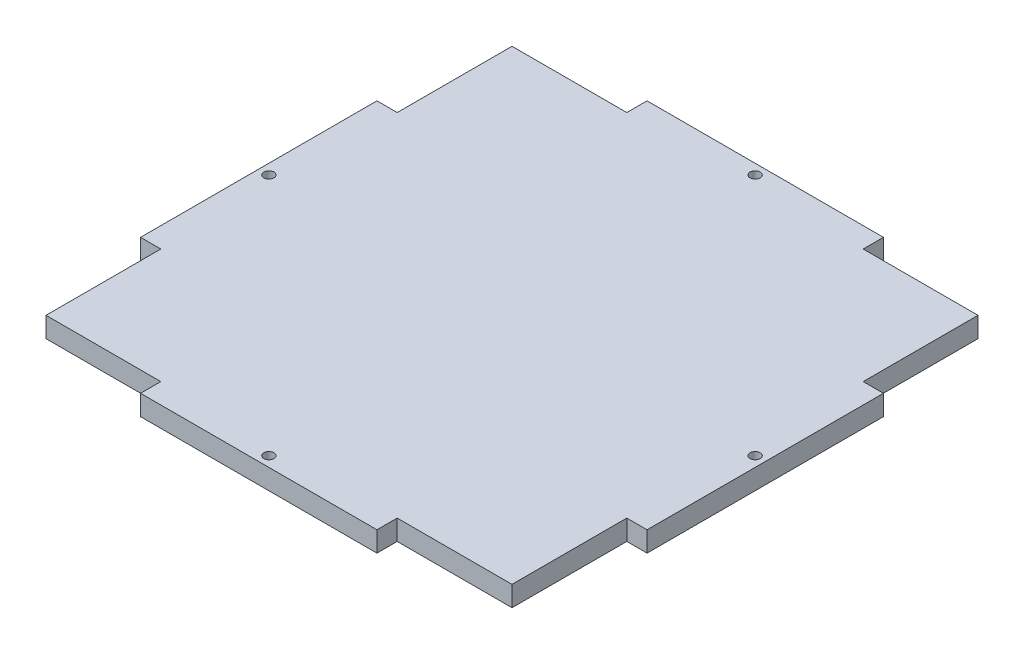
ISO-10303-21;
HEADER;
FILE_DESCRIPTION(('STEP AP214'),'2;1');
FILE_NAME('part.step','',(''),(''),'','','');
FILE_SCHEMA(('AUTOMOTIVE_DESIGN { 1 0 10303 214 1 1 1 1 }'));
ENDSEC;
DATA;
#1=APPLICATION_CONTEXT('core data for automotive mechanical design processes');
#2=APPLICATION_PROTOCOL_DEFINITION('international standard','automotive_design',2000,#1);
#3=PRODUCT_CONTEXT('',#1,'mechanical');
#4=PRODUCT('Part','Part','',(#3));
#5=PRODUCT_RELATED_PRODUCT_CATEGORY('part','',(#4));
#6=PRODUCT_DEFINITION_FORMATION('','',#4);
#7=PRODUCT_DEFINITION_CONTEXT('part definition',#1,'design');
#8=PRODUCT_DEFINITION('design','',#6,#7);
#9=PRODUCT_DEFINITION_SHAPE('','',#8);
#10=(LENGTH_UNIT() NAMED_UNIT(*) SI_UNIT(.MILLI.,.METRE.));
#11=(NAMED_UNIT(*) PLANE_ANGLE_UNIT() SI_UNIT($,.RADIAN.));
#12=(NAMED_UNIT(*) SI_UNIT($,.STERADIAN.) SOLID_ANGLE_UNIT());
#13=UNCERTAINTY_MEASURE_WITH_UNIT(LENGTH_MEASURE(1.E-05),#10,'distance_accuracy_value','');
#14=(GEOMETRIC_REPRESENTATION_CONTEXT(3) GLOBAL_UNCERTAINTY_ASSIGNED_CONTEXT((#13)) GLOBAL_UNIT_ASSIGNED_CONTEXT((#10,
#11,#12)) REPRESENTATION_CONTEXT('',''));
#15=CARTESIAN_POINT('',(0.,0.,0.));
#16=DIRECTION('',(0.,0.,1.));
#17=DIRECTION('',(1.,0.,0.));
#18=AXIS2_PLACEMENT_3D('',#15,#16,#17);
#19=CARTESIAN_POINT('',(-69.,6.,0.));
#20=DIRECTION('',(1.,0.,0.));
#21=DIRECTION('',(0.,0.,-1.));
#22=AXIS2_PLACEMENT_3D('',#19,#20,#21);
#23=PLANE('',#22);
#24=DIRECTION('',(0.,0.,1.));
#25=VECTOR('',#24,1.);
#26=CARTESIAN_POINT('',(-69.,0.,0.));
#27=LINE('',#26,#25);
#28=CARTESIAN_POINT('',(-69.,0.,-69.));
#29=VERTEX_POINT('',#28);
#30=CARTESIAN_POINT('',(-69.,0.,-35.));
#31=VERTEX_POINT('',#30);
#32=EDGE_CURVE('E232',#29,#31,#27,.T.);
#33=ORIENTED_EDGE('',*,*,#32,.T.);
#34=DIRECTION('',(0.,-1.,0.));
#35=VECTOR('',#34,1.);
#36=CARTESIAN_POINT('',(-69.,6.,-35.));
#37=LINE('',#36,#35);
#38=CARTESIAN_POINT('',(-69.,6.,-35.));
#39=VERTEX_POINT('',#38);
#40=EDGE_CURVE('E11',#39,#31,#37,.T.);
#41=ORIENTED_EDGE('',*,*,#40,.F.);
#42=DIRECTION('',(0.,0.,1.));
#43=VECTOR('',#42,1.);
#44=CARTESIAN_POINT('',(-69.,6.,0.));
#45=LINE('',#44,#43);
#46=CARTESIAN_POINT('',(-69.,6.,-69.));
#47=VERTEX_POINT('',#46);
#48=EDGE_CURVE('E133',#47,#39,#45,.T.);
#49=ORIENTED_EDGE('',*,*,#48,.F.);
#50=DIRECTION('',(0.,-1.,0.));
#51=VECTOR('',#50,1.);
#52=CARTESIAN_POINT('',(-69.,6.,-69.));
#53=LINE('',#52,#51);
#54=EDGE_CURVE('E59',#47,#29,#53,.T.);
#55=ORIENTED_EDGE('',*,*,#54,.T.);
#56=EDGE_LOOP('',(#33,#41,#49,#55));
#57=FACE_BOUND('',#56,.T.);
#58=ADVANCED_FACE('F41',(#57),#23,.F.);
#59=CARTESIAN_POINT('',(0.,6.,-34.9999999999999));
#60=DIRECTION('',(0.,0.,-1.));
#61=DIRECTION('',(-1.,0.,0.));
#62=AXIS2_PLACEMENT_3D('',#59,#60,#61);
#63=PLANE('',#62);
#64=DIRECTION('',(1.,0.,0.));
#65=VECTOR('',#64,1.);
#66=CARTESIAN_POINT('',(0.,0.,-34.9999999999999));
#67=LINE('',#66,#65);
#68=CARTESIAN_POINT('',(-75.,0.,-35.));
#69=VERTEX_POINT('',#68);
#70=EDGE_CURVE('E235',#69,#31,#67,.T.);
#71=ORIENTED_EDGE('',*,*,#70,.F.);
#72=DIRECTION('',(0.,-1.,0.));
#73=VECTOR('',#72,1.);
#74=CARTESIAN_POINT('',(-75.,6.,-35.));
#75=LINE('',#74,#73);
#76=CARTESIAN_POINT('',(-75.,6.,-35.));
#77=VERTEX_POINT('',#76);
#78=EDGE_CURVE('E51',#77,#69,#75,.T.);
#79=ORIENTED_EDGE('',*,*,#78,.F.);
#80=DIRECTION('',(1.,0.,0.));
#81=VECTOR('',#80,1.);
#82=CARTESIAN_POINT('',(0.,6.,-34.9999999999999));
#83=LINE('',#82,#81);
#84=EDGE_CURVE('E399',#77,#39,#83,.T.);
#85=ORIENTED_EDGE('',*,*,#84,.T.);
#86=ORIENTED_EDGE('',*,*,#40,.T.);
#87=EDGE_LOOP('',(#71,#79,#85,#86));
#88=FACE_BOUND('',#87,.T.);
#89=ADVANCED_FACE('F43',(#88),#63,.T.);
#90=CARTESIAN_POINT('',(-75.,6.,0.));
#91=DIRECTION('',(-1.,0.,0.));
#92=DIRECTION('',(0.,0.,1.));
#93=AXIS2_PLACEMENT_3D('',#90,#91,#92);
#94=PLANE('',#93);
#95=DIRECTION('',(0.,0.,-1.));
#96=VECTOR('',#95,1.);
#97=CARTESIAN_POINT('',(-75.,0.,0.));
#98=LINE('',#97,#96);
#99=CARTESIAN_POINT('',(-75.,0.,35.));
#100=VERTEX_POINT('',#99);
#101=EDGE_CURVE('E240',#100,#69,#98,.T.);
#102=ORIENTED_EDGE('',*,*,#101,.F.);
#103=DIRECTION('',(0.,-1.,0.));
#104=VECTOR('',#103,1.);
#105=CARTESIAN_POINT('',(-75.,6.,35.));
#106=LINE('',#105,#104);
#107=CARTESIAN_POINT('',(-75.,6.,35.));
#108=VERTEX_POINT('',#107);
#109=EDGE_CURVE('E359',#108,#100,#106,.T.);
#110=ORIENTED_EDGE('',*,*,#109,.F.);
#111=DIRECTION('',(0.,0.,-1.));
#112=VECTOR('',#111,1.);
#113=CARTESIAN_POINT('',(-75.,6.,0.));
#114=LINE('',#113,#112);
#115=EDGE_CURVE('E368',#108,#77,#114,.T.);
#116=ORIENTED_EDGE('',*,*,#115,.T.);
#117=ORIENTED_EDGE('',*,*,#78,.T.);
#118=EDGE_LOOP('',(#102,#110,#116,#117));
#119=FACE_BOUND('',#118,.T.);
#120=ADVANCED_FACE('F366',(#119),#94,.T.);
#121=CARTESIAN_POINT('',(0.,6.,34.9999999999998));
#122=DIRECTION('',(0.,0.,-1.));
#123=DIRECTION('',(-1.,0.,0.));
#124=AXIS2_PLACEMENT_3D('',#121,#122,#123);
#125=PLANE('',#124);
#126=DIRECTION('',(1.,0.,0.));
#127=VECTOR('',#126,1.);
#128=CARTESIAN_POINT('',(0.,0.,34.9999999999998));
#129=LINE('',#128,#127);
#130=CARTESIAN_POINT('',(-69.,0.,35.));
#131=VERTEX_POINT('',#130);
#132=EDGE_CURVE('E244',#100,#131,#129,.T.);
#133=ORIENTED_EDGE('',*,*,#132,.T.);
#134=DIRECTION('',(0.,-1.,0.));
#135=VECTOR('',#134,1.);
#136=CARTESIAN_POINT('',(-69.,6.,35.));
#137=LINE('',#136,#135);
#138=CARTESIAN_POINT('',(-69.,6.,35.));
#139=VERTEX_POINT('',#138);
#140=EDGE_CURVE('E355',#139,#131,#137,.T.);
#141=ORIENTED_EDGE('',*,*,#140,.F.);
#142=DIRECTION('',(1.,0.,0.));
#143=VECTOR('',#142,1.);
#144=CARTESIAN_POINT('',(0.,6.,34.9999999999998));
#145=LINE('',#144,#143);
#146=EDGE_CURVE('E389',#108,#139,#145,.T.);
#147=ORIENTED_EDGE('',*,*,#146,.F.);
#148=ORIENTED_EDGE('',*,*,#109,.T.);
#149=EDGE_LOOP('',(#133,#141,#147,#148));
#150=FACE_BOUND('',#149,.T.);
#151=ADVANCED_FACE('F379',(#150),#125,.F.);
#152=CARTESIAN_POINT('',(-69.,0.,69.));
#153=VERTEX_POINT('',#152);
#154=EDGE_CURVE('E236',#131,#153,#27,.T.);
#155=ORIENTED_EDGE('',*,*,#154,.T.);
#156=DIRECTION('',(0.,-1.,0.));
#157=VECTOR('',#156,1.);
#158=CARTESIAN_POINT('',(-69.,6.,69.));
#159=LINE('',#158,#157);
#160=CARTESIAN_POINT('',(-69.,6.,69.));
#161=VERTEX_POINT('',#160);
#162=EDGE_CURVE('E351',#161,#153,#159,.T.);
#163=ORIENTED_EDGE('',*,*,#162,.F.);
#164=EDGE_CURVE('E385',#139,#161,#45,.T.);
#165=ORIENTED_EDGE('',*,*,#164,.F.);
#166=ORIENTED_EDGE('',*,*,#140,.T.);
#167=EDGE_LOOP('',(#155,#163,#165,#166));
#168=FACE_BOUND('',#167,.T.);
#169=ADVANCED_FACE('F383',(#168),#23,.F.);
#170=CARTESIAN_POINT('',(0.,6.,69.));
#171=DIRECTION('',(0.,0.,-1.));
#172=DIRECTION('',(-1.,0.,0.));
#173=AXIS2_PLACEMENT_3D('',#170,#171,#172);
#174=PLANE('',#173);
#175=DIRECTION('',(1.,0.,0.));
#176=VECTOR('',#175,1.);
#177=CARTESIAN_POINT('',(0.,0.,69.));
#178=LINE('',#177,#176);
#179=CARTESIAN_POINT('',(-35.,0.,69.));
#180=VERTEX_POINT('',#179);
#181=EDGE_CURVE('E247',#153,#180,#178,.T.);
#182=ORIENTED_EDGE('',*,*,#181,.T.);
#183=DIRECTION('',(0.,-1.,0.));
#184=VECTOR('',#183,1.);
#185=CARTESIAN_POINT('',(-35.,6.,69.));
#186=LINE('',#185,#184);
#187=CARTESIAN_POINT('',(-35.,6.,69.));
#188=VERTEX_POINT('',#187);
#189=EDGE_CURVE('E348',#188,#180,#186,.T.);
#190=ORIENTED_EDGE('',*,*,#189,.F.);
#191=DIRECTION('',(1.,0.,0.));
#192=VECTOR('',#191,1.);
#193=CARTESIAN_POINT('',(0.,6.,69.));
#194=LINE('',#193,#192);
#195=EDGE_CURVE('E388',#161,#188,#194,.T.);
#196=ORIENTED_EDGE('',*,*,#195,.F.);
#197=ORIENTED_EDGE('',*,*,#162,.T.);
#198=EDGE_LOOP('',(#182,#190,#196,#197));
#199=FACE_BOUND('',#198,.T.);
#200=ADVANCED_FACE('F459',(#199),#174,.F.);
#201=CARTESIAN_POINT('',(-35.,6.,0.));
#202=DIRECTION('',(-1.,0.,0.));
#203=DIRECTION('',(0.,0.,1.));
#204=AXIS2_PLACEMENT_3D('',#201,#202,#203);
#205=PLANE('',#204);
#206=DIRECTION('',(0.,0.,-1.));
#207=VECTOR('',#206,1.);
#208=CARTESIAN_POINT('',(-35.,0.,0.));
#209=LINE('',#208,#207);
#210=CARTESIAN_POINT('',(-35.,0.,75.));
#211=VERTEX_POINT('',#210);
#212=EDGE_CURVE('E251',#211,#180,#209,.T.);
#213=ORIENTED_EDGE('',*,*,#212,.F.);
#214=DIRECTION('',(0.,-1.,0.));
#215=VECTOR('',#214,1.);
#216=CARTESIAN_POINT('',(-35.,6.,75.));
#217=LINE('',#216,#215);
#218=CARTESIAN_POINT('',(-35.,6.,75.));
#219=VERTEX_POINT('',#218);
#220=EDGE_CURVE('E345',#219,#211,#217,.T.);
#221=ORIENTED_EDGE('',*,*,#220,.F.);
#222=DIRECTION('',(0.,0.,-1.));
#223=VECTOR('',#222,1.);
#224=CARTESIAN_POINT('',(-35.,6.,0.));
#225=LINE('',#224,#223);
#226=EDGE_CURVE('E393',#219,#188,#225,.T.);
#227=ORIENTED_EDGE('',*,*,#226,.T.);
#228=ORIENTED_EDGE('',*,*,#189,.T.);
#229=EDGE_LOOP('',(#213,#221,#227,#228));
#230=FACE_BOUND('',#229,.T.);
#231=ADVANCED_FACE('F464',(#230),#205,.T.);
#232=CARTESIAN_POINT('',(0.,6.,75.));
#233=DIRECTION('',(0.,0.,-1.));
#234=DIRECTION('',(-1.,0.,0.));
#235=AXIS2_PLACEMENT_3D('',#232,#233,#234);
#236=PLANE('',#235);
#237=DIRECTION('',(1.,0.,0.));
#238=VECTOR('',#237,1.);
#239=CARTESIAN_POINT('',(0.,0.,75.));
#240=LINE('',#239,#238);
#241=CARTESIAN_POINT('',(35.,0.,75.));
#242=VERTEX_POINT('',#241);
#243=EDGE_CURVE('E256',#211,#242,#240,.T.);
#244=ORIENTED_EDGE('',*,*,#243,.T.);
#245=DIRECTION('',(0.,-1.,0.));
#246=VECTOR('',#245,1.);
#247=CARTESIAN_POINT('',(35.,6.,75.));
#248=LINE('',#247,#246);
#249=CARTESIAN_POINT('',(35.,6.,75.));
#250=VERTEX_POINT('',#249);
#251=EDGE_CURVE('E341',#250,#242,#248,.T.);
#252=ORIENTED_EDGE('',*,*,#251,.F.);
#253=DIRECTION('',(1.,0.,0.));
#254=VECTOR('',#253,1.);
#255=CARTESIAN_POINT('',(0.,6.,75.));
#256=LINE('',#255,#254);
#257=EDGE_CURVE('E407',#219,#250,#256,.T.);
#258=ORIENTED_EDGE('',*,*,#257,.F.);
#259=ORIENTED_EDGE('',*,*,#220,.T.);
#260=EDGE_LOOP('',(#244,#252,#258,#259));
#261=FACE_BOUND('',#260,.T.);
#262=ADVANCED_FACE('F521',(#261),#236,.F.);
#263=CARTESIAN_POINT('',(35.0000000000001,6.,0.));
#264=DIRECTION('',(-1.,0.,0.));
#265=DIRECTION('',(0.,0.,1.));
#266=AXIS2_PLACEMENT_3D('',#263,#264,#265);
#267=PLANE('',#266);
#268=DIRECTION('',(0.,0.,-1.));
#269=VECTOR('',#268,1.);
#270=CARTESIAN_POINT('',(35.0000000000001,0.,0.));
#271=LINE('',#270,#269);
#272=CARTESIAN_POINT('',(35.,0.,69.));
#273=VERTEX_POINT('',#272);
#274=EDGE_CURVE('E259',#242,#273,#271,.T.);
#275=ORIENTED_EDGE('',*,*,#274,.T.);
#276=DIRECTION('',(0.,-1.,0.));
#277=VECTOR('',#276,1.);
#278=CARTESIAN_POINT('',(35.,6.,69.));
#279=LINE('',#278,#277);
#280=CARTESIAN_POINT('',(35.,6.,69.));
#281=VERTEX_POINT('',#280);
#282=EDGE_CURVE('E337',#281,#273,#279,.T.);
#283=ORIENTED_EDGE('',*,*,#282,.F.);
#284=DIRECTION('',(0.,0.,-1.));
#285=VECTOR('',#284,1.);
#286=CARTESIAN_POINT('',(35.0000000000001,6.,0.));
#287=LINE('',#286,#285);
#288=EDGE_CURVE('E410',#250,#281,#287,.T.);
#289=ORIENTED_EDGE('',*,*,#288,.F.);
#290=ORIENTED_EDGE('',*,*,#251,.T.);
#291=EDGE_LOOP('',(#275,#283,#289,#290));
#292=FACE_BOUND('',#291,.T.);
#293=ADVANCED_FACE('F529',(#292),#267,.F.);
#294=CARTESIAN_POINT('',(69.,0.,69.));
#295=VERTEX_POINT('',#294);
#296=EDGE_CURVE('E252',#273,#295,#178,.T.);
#297=ORIENTED_EDGE('',*,*,#296,.T.);
#298=DIRECTION('',(0.,-1.,0.));
#299=VECTOR('',#298,1.);
#300=CARTESIAN_POINT('',(69.,6.,69.));
#301=LINE('',#300,#299);
#302=CARTESIAN_POINT('',(69.,6.,69.));
#303=VERTEX_POINT('',#302);
#304=EDGE_CURVE('E333',#303,#295,#301,.T.);
#305=ORIENTED_EDGE('',*,*,#304,.F.);
#306=EDGE_CURVE('E395',#281,#303,#194,.T.);
#307=ORIENTED_EDGE('',*,*,#306,.F.);
#308=ORIENTED_EDGE('',*,*,#282,.T.);
#309=EDGE_LOOP('',(#297,#305,#307,#308));
#310=FACE_BOUND('',#309,.T.);
#311=ADVANCED_FACE('F467',(#310),#174,.F.);
#312=CARTESIAN_POINT('',(69.,6.,0.));
#313=DIRECTION('',(-1.,0.,0.));
#314=DIRECTION('',(0.,0.,1.));
#315=AXIS2_PLACEMENT_3D('',#312,#313,#314);
#316=PLANE('',#315);
#317=DIRECTION('',(0.,0.,-1.));
#318=VECTOR('',#317,1.);
#319=CARTESIAN_POINT('',(69.,0.,0.));
#320=LINE('',#319,#318);
#321=CARTESIAN_POINT('',(69.,0.,35.));
#322=VERTEX_POINT('',#321);
#323=EDGE_CURVE('E262',#295,#322,#320,.T.);
#324=ORIENTED_EDGE('',*,*,#323,.T.);
#325=DIRECTION('',(0.,-1.,0.));
#326=VECTOR('',#325,1.);
#327=CARTESIAN_POINT('',(69.,6.,35.));
#328=LINE('',#327,#326);
#329=CARTESIAN_POINT('',(69.,6.,35.));
#330=VERTEX_POINT('',#329);
#331=EDGE_CURVE('E330',#330,#322,#328,.T.);
#332=ORIENTED_EDGE('',*,*,#331,.F.);
#333=DIRECTION('',(0.,0.,-1.));
#334=VECTOR('',#333,1.);
#335=CARTESIAN_POINT('',(69.,6.,0.));
#336=LINE('',#335,#334);
#337=EDGE_CURVE('E413',#303,#330,#336,.T.);
#338=ORIENTED_EDGE('',*,*,#337,.F.);
#339=ORIENTED_EDGE('',*,*,#304,.T.);
#340=EDGE_LOOP('',(#324,#332,#338,#339));
#341=FACE_BOUND('',#340,.T.);
#342=ADVANCED_FACE('F549',(#341),#316,.F.);
#343=CARTESIAN_POINT('',(-1.61907524424501E-13,6.,34.9999999999996));
#344=DIRECTION('',(0.,0.,1.));
#345=DIRECTION('',(1.,0.,0.));
#346=AXIS2_PLACEMENT_3D('',#343,#344,#345);
#347=PLANE('',#346);
#348=DIRECTION('',(-1.,0.,0.));
#349=VECTOR('',#348,1.);
#350=CARTESIAN_POINT('',(-1.61907524424501E-13,0.,34.9999999999996));
#351=LINE('',#350,#349);
#352=CARTESIAN_POINT('',(75.,0.,35.));
#353=VERTEX_POINT('',#352);
#354=EDGE_CURVE('E266',#353,#322,#351,.T.);
#355=ORIENTED_EDGE('',*,*,#354,.F.);
#356=DIRECTION('',(0.,-1.,0.));
#357=VECTOR('',#356,1.);
#358=CARTESIAN_POINT('',(75.,6.,35.));
#359=LINE('',#358,#357);
#360=CARTESIAN_POINT('',(75.,6.,35.));
#361=VERTEX_POINT('',#360);
#362=EDGE_CURVE('E327',#361,#353,#359,.T.);
#363=ORIENTED_EDGE('',*,*,#362,.F.);
#364=DIRECTION('',(-1.,0.,0.));
#365=VECTOR('',#364,1.);
#366=CARTESIAN_POINT('',(-1.61907524424501E-13,6.,34.9999999999996));
#367=LINE('',#366,#365);
#368=EDGE_CURVE('E416',#361,#330,#367,.T.);
#369=ORIENTED_EDGE('',*,*,#368,.T.);
#370=ORIENTED_EDGE('',*,*,#331,.T.);
#371=EDGE_LOOP('',(#355,#363,#369,#370));
#372=FACE_BOUND('',#371,.T.);
#373=ADVANCED_FACE('F563',(#372),#347,.T.);
#374=CARTESIAN_POINT('',(75.,6.,0.));
#375=DIRECTION('',(-1.,0.,0.));
#376=DIRECTION('',(0.,0.,1.));
#377=AXIS2_PLACEMENT_3D('',#374,#375,#376);
#378=PLANE('',#377);
#379=DIRECTION('',(0.,0.,-1.));
#380=VECTOR('',#379,1.);
#381=CARTESIAN_POINT('',(75.,0.,0.));
#382=LINE('',#381,#380);
#383=CARTESIAN_POINT('',(75.,0.,-35.));
#384=VERTEX_POINT('',#383);
#385=EDGE_CURVE('E271',#353,#384,#382,.T.);
#386=ORIENTED_EDGE('',*,*,#385,.T.);
#387=DIRECTION('',(0.,-1.,0.));
#388=VECTOR('',#387,1.);
#389=CARTESIAN_POINT('',(75.,6.,-35.));
#390=LINE('',#389,#388);
#391=CARTESIAN_POINT('',(75.,6.,-35.));
#392=VERTEX_POINT('',#391);
#393=EDGE_CURVE('E323',#392,#384,#390,.T.);
#394=ORIENTED_EDGE('',*,*,#393,.F.);
#395=DIRECTION('',(0.,0.,-1.));
#396=VECTOR('',#395,1.);
#397=CARTESIAN_POINT('',(75.,6.,0.));
#398=LINE('',#397,#396);
#399=EDGE_CURVE('E421',#361,#392,#398,.T.);
#400=ORIENTED_EDGE('',*,*,#399,.F.);
#401=ORIENTED_EDGE('',*,*,#362,.T.);
#402=EDGE_LOOP('',(#386,#394,#400,#401));
#403=FACE_BOUND('',#402,.T.);
#404=ADVANCED_FACE('F575',(#403),#378,.F.);
#405=CARTESIAN_POINT('',(-3.23815048848995E-13,6.,-34.9999999999994));
#406=DIRECTION('',(0.,0.,1.));
#407=DIRECTION('',(1.,0.,0.));
#408=AXIS2_PLACEMENT_3D('',#405,#406,#407);
#409=PLANE('',#408);
#410=DIRECTION('',(-1.,0.,0.));
#411=VECTOR('',#410,1.);
#412=CARTESIAN_POINT('',(-3.23815048848995E-13,0.,-34.9999999999994));
#413=LINE('',#412,#411);
#414=CARTESIAN_POINT('',(69.,0.,-35.));
#415=VERTEX_POINT('',#414);
#416=EDGE_CURVE('E274',#384,#415,#413,.T.);
#417=ORIENTED_EDGE('',*,*,#416,.T.);
#418=DIRECTION('',(0.,-1.,0.));
#419=VECTOR('',#418,1.);
#420=CARTESIAN_POINT('',(69.,6.,-35.));
#421=LINE('',#420,#419);
#422=CARTESIAN_POINT('',(69.,6.,-35.));
#423=VERTEX_POINT('',#422);
#424=EDGE_CURVE('E319',#423,#415,#421,.T.);
#425=ORIENTED_EDGE('',*,*,#424,.F.);
#426=DIRECTION('',(-1.,0.,0.));
#427=VECTOR('',#426,1.);
#428=CARTESIAN_POINT('',(-3.23815048848995E-13,6.,-34.9999999999994));
#429=LINE('',#428,#427);
#430=EDGE_CURVE('E424',#392,#423,#429,.T.);
#431=ORIENTED_EDGE('',*,*,#430,.F.);
#432=ORIENTED_EDGE('',*,*,#393,.T.);
#433=EDGE_LOOP('',(#417,#425,#431,#432));
#434=FACE_BOUND('',#433,.T.);
#435=ADVANCED_FACE('F584',(#434),#409,.F.);
#436=CARTESIAN_POINT('',(69.,0.,-69.));
#437=VERTEX_POINT('',#436);
#438=EDGE_CURVE('E267',#415,#437,#320,.T.);
#439=ORIENTED_EDGE('',*,*,#438,.T.);
#440=DIRECTION('',(0.,-1.,0.));
#441=VECTOR('',#440,1.);
#442=CARTESIAN_POINT('',(69.,6.,-69.));
#443=LINE('',#442,#441);
#444=CARTESIAN_POINT('',(69.,6.,-69.));
#445=VERTEX_POINT('',#444);
#446=EDGE_CURVE('E316',#445,#437,#443,.T.);
#447=ORIENTED_EDGE('',*,*,#446,.F.);
#448=EDGE_CURVE('E417',#423,#445,#336,.T.);
#449=ORIENTED_EDGE('',*,*,#448,.F.);
#450=ORIENTED_EDGE('',*,*,#424,.T.);
#451=EDGE_LOOP('',(#439,#447,#449,#450));
#452=FACE_BOUND('',#451,.T.);
#453=ADVANCED_FACE('F450',(#452),#316,.F.);
#454=CARTESIAN_POINT('',(0.,6.,-69.));
#455=DIRECTION('',(0.,0.,-1.));
#456=DIRECTION('',(-1.,0.,0.));
#457=AXIS2_PLACEMENT_3D('',#454,#455,#456);
#458=PLANE('',#457);
#459=DIRECTION('',(1.,0.,0.));
#460=VECTOR('',#459,1.);
#461=CARTESIAN_POINT('',(0.,0.,-69.));
#462=LINE('',#461,#460);
#463=CARTESIAN_POINT('',(35.,0.,-69.));
#464=VERTEX_POINT('',#463);
#465=EDGE_CURVE('E277',#464,#437,#462,.T.);
#466=ORIENTED_EDGE('',*,*,#465,.F.);
#467=DIRECTION('',(0.,-1.,0.));
#468=VECTOR('',#467,1.);
#469=CARTESIAN_POINT('',(35.,6.,-69.));
#470=LINE('',#469,#468);
#471=CARTESIAN_POINT('',(35.,6.,-69.));
#472=VERTEX_POINT('',#471);
#473=EDGE_CURVE('E313',#472,#464,#470,.T.);
#474=ORIENTED_EDGE('',*,*,#473,.F.);
#475=DIRECTION('',(1.,0.,0.));
#476=VECTOR('',#475,1.);
#477=CARTESIAN_POINT('',(0.,6.,-69.));
#478=LINE('',#477,#476);
#479=EDGE_CURVE('E212',#472,#445,#478,.T.);
#480=ORIENTED_EDGE('',*,*,#479,.T.);
#481=ORIENTED_EDGE('',*,*,#446,.T.);
#482=EDGE_LOOP('',(#466,#474,#480,#481));
#483=FACE_BOUND('',#482,.T.);
#484=ADVANCED_FACE('F437',(#483),#458,.T.);
#485=CARTESIAN_POINT('',(35.0000000000001,6.,0.));
#486=DIRECTION('',(1.,0.,0.));
#487=DIRECTION('',(0.,0.,-1.));
#488=AXIS2_PLACEMENT_3D('',#485,#486,#487);
#489=PLANE('',#488);
#490=DIRECTION('',(0.,0.,1.));
#491=VECTOR('',#490,1.);
#492=CARTESIAN_POINT('',(35.0000000000001,0.,0.));
#493=LINE('',#492,#491);
#494=CARTESIAN_POINT('',(35.,0.,-75.));
#495=VERTEX_POINT('',#494);
#496=EDGE_CURVE('E281',#495,#464,#493,.T.);
#497=ORIENTED_EDGE('',*,*,#496,.F.);
#498=DIRECTION('',(0.,-1.,0.));
#499=VECTOR('',#498,1.);
#500=CARTESIAN_POINT('',(35.,6.,-75.));
#501=LINE('',#500,#499);
#502=CARTESIAN_POINT('',(35.,6.,-75.));
#503=VERTEX_POINT('',#502);
#504=EDGE_CURVE('E196',#503,#495,#501,.T.);
#505=ORIENTED_EDGE('',*,*,#504,.F.);
#506=DIRECTION('',(0.,0.,1.));
#507=VECTOR('',#506,1.);
#508=CARTESIAN_POINT('',(35.0000000000001,6.,0.));
#509=LINE('',#508,#507);
#510=EDGE_CURVE('E208',#503,#472,#509,.T.);
#511=ORIENTED_EDGE('',*,*,#510,.T.);
#512=ORIENTED_EDGE('',*,*,#473,.T.);
#513=EDGE_LOOP('',(#497,#505,#511,#512));
#514=FACE_BOUND('',#513,.T.);
#515=ADVANCED_FACE('F449',(#514),#489,.T.);
#516=CARTESIAN_POINT('',(0.,6.,-75.));
#517=DIRECTION('',(0.,0.,-1.));
#518=DIRECTION('',(-1.,0.,0.));
#519=AXIS2_PLACEMENT_3D('',#516,#517,#518);
#520=PLANE('',#519);
#521=DIRECTION('',(1.,0.,0.));
#522=VECTOR('',#521,1.);
#523=CARTESIAN_POINT('',(0.,0.,-75.));
#524=LINE('',#523,#522);
#525=CARTESIAN_POINT('',(-35.,0.,-75.));
#526=VERTEX_POINT('',#525);
#527=EDGE_CURVE('E192',#526,#495,#524,.T.);
#528=ORIENTED_EDGE('',*,*,#527,.F.);
#529=DIRECTION('',(0.,-1.,0.));
#530=VECTOR('',#529,1.);
#531=CARTESIAN_POINT('',(-35.,6.,-75.));
#532=LINE('',#531,#530);
#533=CARTESIAN_POINT('',(-35.,6.,-75.));
#534=VERTEX_POINT('',#533);
#535=EDGE_CURVE('E186',#534,#526,#532,.T.);
#536=ORIENTED_EDGE('',*,*,#535,.F.);
#537=DIRECTION('',(1.,0.,0.));
#538=VECTOR('',#537,1.);
#539=CARTESIAN_POINT('',(0.,6.,-75.));
#540=LINE('',#539,#538);
#541=EDGE_CURVE('E190',#534,#503,#540,.T.);
#542=ORIENTED_EDGE('',*,*,#541,.T.);
#543=ORIENTED_EDGE('',*,*,#504,.T.);
#544=EDGE_LOOP('',(#528,#536,#542,#543));
#545=FACE_BOUND('',#544,.T.);
#546=ADVANCED_FACE('F188',(#545),#520,.T.);
#547=CARTESIAN_POINT('',(-35.,6.,0.));
#548=DIRECTION('',(1.,0.,0.));
#549=DIRECTION('',(0.,0.,-1.));
#550=AXIS2_PLACEMENT_3D('',#547,#548,#549);
#551=PLANE('',#550);
#552=DIRECTION('',(0.,0.,1.));
#553=VECTOR('',#552,1.);
#554=CARTESIAN_POINT('',(-35.,0.,0.));
#555=LINE('',#554,#553);
#556=CARTESIAN_POINT('',(-35.,0.,-69.));
#557=VERTEX_POINT('',#556);
#558=EDGE_CURVE('E288',#526,#557,#555,.T.);
#559=ORIENTED_EDGE('',*,*,#558,.T.);
#560=DIRECTION('',(0.,-1.,0.));
#561=VECTOR('',#560,1.);
#562=CARTESIAN_POINT('',(-35.,6.,-69.));
#563=LINE('',#562,#561);
#564=CARTESIAN_POINT('',(-35.,6.,-69.));
#565=VERTEX_POINT('',#564);
#566=EDGE_CURVE('E121',#565,#557,#563,.T.);
#567=ORIENTED_EDGE('',*,*,#566,.F.);
#568=DIRECTION('',(0.,0.,1.));
#569=VECTOR('',#568,1.);
#570=CARTESIAN_POINT('',(-35.,6.,0.));
#571=LINE('',#570,#569);
#572=EDGE_CURVE('E198',#534,#565,#571,.T.);
#573=ORIENTED_EDGE('',*,*,#572,.F.);
#574=ORIENTED_EDGE('',*,*,#535,.T.);
#575=EDGE_LOOP('',(#559,#567,#573,#574));
#576=FACE_BOUND('',#575,.T.);
#577=ADVANCED_FACE('F199',(#576),#551,.F.);
#578=CARTESIAN_POINT('',(0.,6.,72.));
#579=DIRECTION('',(0.,-1.,0.));
#580=DIRECTION('',(0.,0.,-1.));
#581=AXIS2_PLACEMENT_3D('',#578,#579,#580);
#582=CYLINDRICAL_SURFACE('',#581,1.5);
#583=CARTESIAN_POINT('',(0.,6.,72.));
#584=DIRECTION('',(0.,1.,0.));
#585=DIRECTION('',(0.,0.,1.));
#586=AXIS2_PLACEMENT_3D('',#583,#584,#585);
#587=CIRCLE('',#586,1.5);
#588=CARTESIAN_POINT('',(0.,6.,73.5));
#589=VERTEX_POINT('',#588);
#590=EDGE_CURVE('E224',#589,#589,#587,.F.);
#591=ORIENTED_EDGE('',*,*,#590,.F.);
#592=EDGE_LOOP('',(#591));
#593=FACE_BOUND('',#592,.T.);
#594=CARTESIAN_POINT('',(0.,0.,72.));
#595=DIRECTION('',(0.,1.,0.));
#596=DIRECTION('',(0.,0.,1.));
#597=AXIS2_PLACEMENT_3D('',#594,#595,#596);
#598=CIRCLE('',#597,1.5);
#599=CARTESIAN_POINT('',(0.,0.,73.5));
#600=VERTEX_POINT('',#599);
#601=EDGE_CURVE('E299',#600,#600,#598,.F.);
#602=ORIENTED_EDGE('',*,*,#601,.T.);
#603=EDGE_LOOP('',(#602));
#604=FACE_BOUND('',#603,.T.);
#605=ADVANCED_FACE('F643',(#593,#604),#582,.F.);
#606=CARTESIAN_POINT('',(72.,6.,0.));
#607=DIRECTION('',(0.,-1.,0.));
#608=DIRECTION('',(0.,0.,-1.));
#609=AXIS2_PLACEMENT_3D('',#606,#607,#608);
#610=CYLINDRICAL_SURFACE('',#609,1.49999999999996);
#611=CARTESIAN_POINT('',(72.,6.,0.));
#612=DIRECTION('',(0.,1.,0.));
#613=DIRECTION('',(0.,0.,1.));
#614=AXIS2_PLACEMENT_3D('',#611,#612,#613);
#615=CIRCLE('',#614,1.49999999999996);
#616=CARTESIAN_POINT('',(72.,6.,1.49999999999989));
#617=VERTEX_POINT('',#616);
#618=EDGE_CURVE('E220',#617,#617,#615,.F.);
#619=ORIENTED_EDGE('',*,*,#618,.F.);
#620=EDGE_LOOP('',(#619));
#621=FACE_BOUND('',#620,.T.);
#622=CARTESIAN_POINT('',(72.,0.,0.));
#623=DIRECTION('',(0.,1.,0.));
#624=DIRECTION('',(0.,0.,1.));
#625=AXIS2_PLACEMENT_3D('',#622,#623,#624);
#626=CIRCLE('',#625,1.49999999999996);
#627=CARTESIAN_POINT('',(72.,0.,1.49999999999989));
#628=VERTEX_POINT('',#627);
#629=EDGE_CURVE('E295',#628,#628,#626,.F.);
#630=ORIENTED_EDGE('',*,*,#629,.T.);
#631=EDGE_LOOP('',(#630));
#632=FACE_BOUND('',#631,.T.);
#633=ADVANCED_FACE('F444',(#621,#632),#610,.F.);
#634=CARTESIAN_POINT('',(0.,6.,-72.));
#635=DIRECTION('',(0.,-1.,0.));
#636=DIRECTION('',(0.,0.,-1.));
#637=AXIS2_PLACEMENT_3D('',#634,#635,#636);
#638=CYLINDRICAL_SURFACE('',#637,1.5);
#639=CARTESIAN_POINT('',(0.,6.,-72.));
#640=DIRECTION('',(0.,1.,0.));
#641=DIRECTION('',(0.,0.,1.));
#642=AXIS2_PLACEMENT_3D('',#639,#640,#641);
#643=CIRCLE('',#642,1.5);
#644=CARTESIAN_POINT('',(0.,6.,-70.5));
#645=VERTEX_POINT('',#644);
#646=EDGE_CURVE('E216',#645,#645,#643,.T.);
#647=ORIENTED_EDGE('',*,*,#646,.T.);
#648=EDGE_LOOP('',(#647));
#649=FACE_BOUND('',#648,.T.);
#650=CARTESIAN_POINT('',(0.,0.,-72.));
#651=DIRECTION('',(0.,1.,0.));
#652=DIRECTION('',(0.,0.,1.));
#653=AXIS2_PLACEMENT_3D('',#650,#651,#652);
#654=CIRCLE('',#653,1.5);
#655=CARTESIAN_POINT('',(0.,0.,-70.5));
#656=VERTEX_POINT('',#655);
#657=EDGE_CURVE('E291',#656,#656,#654,.T.);
#658=ORIENTED_EDGE('',*,*,#657,.F.);
#659=EDGE_LOOP('',(#658));
#660=FACE_BOUND('',#659,.T.);
#661=ADVANCED_FACE('F435',(#649,#660),#638,.F.);
#662=EDGE_CURVE('E282',#29,#557,#462,.T.);
#663=ORIENTED_EDGE('',*,*,#662,.F.);
#664=ORIENTED_EDGE('',*,*,#54,.F.);
#665=EDGE_CURVE('E201',#47,#565,#478,.T.);
#666=ORIENTED_EDGE('',*,*,#665,.T.);
#667=ORIENTED_EDGE('',*,*,#566,.T.);
#668=EDGE_LOOP('',(#663,#664,#666,#667));
#669=FACE_BOUND('',#668,.T.);
#670=ADVANCED_FACE('F431',(#669),#458,.T.);
#671=CARTESIAN_POINT('',(-72.,6.,0.));
#672=DIRECTION('',(0.,-1.,0.));
#673=DIRECTION('',(0.,0.,-1.));
#674=AXIS2_PLACEMENT_3D('',#671,#672,#673);
#675=CYLINDRICAL_SURFACE('',#674,1.5);
#676=CARTESIAN_POINT('',(-72.,6.,0.));
#677=DIRECTION('',(0.,1.,0.));
#678=DIRECTION('',(0.,0.,1.));
#679=AXIS2_PLACEMENT_3D('',#676,#677,#678);
#680=CIRCLE('',#679,1.5);
#681=CARTESIAN_POINT('',(-72.,6.,1.50000000000003));
#682=VERTEX_POINT('',#681);
#683=EDGE_CURVE('E228',#682,#682,#680,.F.);
#684=ORIENTED_EDGE('',*,*,#683,.F.);
#685=EDGE_LOOP('',(#684));
#686=FACE_BOUND('',#685,.T.);
#687=CARTESIAN_POINT('',(-72.,0.,0.));
#688=DIRECTION('',(0.,1.,0.));
#689=DIRECTION('',(0.,0.,1.));
#690=AXIS2_PLACEMENT_3D('',#687,#688,#689);
#691=CIRCLE('',#690,1.5);
#692=CARTESIAN_POINT('',(-72.,0.,1.50000000000003));
#693=VERTEX_POINT('',#692);
#694=EDGE_CURVE('E303',#693,#693,#691,.F.);
#695=ORIENTED_EDGE('',*,*,#694,.T.);
#696=EDGE_LOOP('',(#695));
#697=FACE_BOUND('',#696,.T.);
#698=ADVANCED_FACE('F434',(#686,#697),#675,.F.);
#699=CARTESIAN_POINT('',(0.,6.,0.));
#700=DIRECTION('',(0.,1.,0.));
#701=DIRECTION('',(0.,0.,1.));
#702=AXIS2_PLACEMENT_3D('',#699,#700,#701);
#703=PLANE('',#702);
#704=ORIENTED_EDGE('',*,*,#48,.T.);
#705=ORIENTED_EDGE('',*,*,#84,.F.);
#706=ORIENTED_EDGE('',*,*,#115,.F.);
#707=ORIENTED_EDGE('',*,*,#146,.T.);
#708=ORIENTED_EDGE('',*,*,#164,.T.);
#709=ORIENTED_EDGE('',*,*,#195,.T.);
#710=ORIENTED_EDGE('',*,*,#226,.F.);
#711=ORIENTED_EDGE('',*,*,#257,.T.);
#712=ORIENTED_EDGE('',*,*,#288,.T.);
#713=ORIENTED_EDGE('',*,*,#306,.T.);
#714=ORIENTED_EDGE('',*,*,#337,.T.);
#715=ORIENTED_EDGE('',*,*,#368,.F.);
#716=ORIENTED_EDGE('',*,*,#399,.T.);
#717=ORIENTED_EDGE('',*,*,#430,.T.);
#718=ORIENTED_EDGE('',*,*,#448,.T.);
#719=ORIENTED_EDGE('',*,*,#479,.F.);
#720=ORIENTED_EDGE('',*,*,#510,.F.);
#721=ORIENTED_EDGE('',*,*,#541,.F.);
#722=ORIENTED_EDGE('',*,*,#572,.T.);
#723=ORIENTED_EDGE('',*,*,#665,.F.);
#724=EDGE_LOOP('',(#704,#705,#706,#707,#708,#709,#710,#711,#712,#713,#714,#715,#716,#717,#718,
#719,#720,#721,#722,#723));
#725=FACE_BOUND('',#724,.T.);
#726=ORIENTED_EDGE('',*,*,#646,.F.);
#727=EDGE_LOOP('',(#726));
#728=FACE_BOUND('',#727,.T.);
#729=ORIENTED_EDGE('',*,*,#618,.T.);
#730=EDGE_LOOP('',(#729));
#731=FACE_BOUND('',#730,.T.);
#732=ORIENTED_EDGE('',*,*,#590,.T.);
#733=EDGE_LOOP('',(#732));
#734=FACE_BOUND('',#733,.T.);
#735=ORIENTED_EDGE('',*,*,#683,.T.);
#736=EDGE_LOOP('',(#735));
#737=FACE_BOUND('',#736,.T.);
#738=ADVANCED_FACE('F204',(#725,#728,#731,#734,#737),#703,.T.);
#739=CARTESIAN_POINT('',(0.,0.,0.));
#740=DIRECTION('',(0.,1.,0.));
#741=DIRECTION('',(0.,0.,1.));
#742=AXIS2_PLACEMENT_3D('',#739,#740,#741);
#743=PLANE('',#742);
#744=ORIENTED_EDGE('',*,*,#32,.F.);
#745=ORIENTED_EDGE('',*,*,#662,.T.);
#746=ORIENTED_EDGE('',*,*,#558,.F.);
#747=ORIENTED_EDGE('',*,*,#527,.T.);
#748=ORIENTED_EDGE('',*,*,#496,.T.);
#749=ORIENTED_EDGE('',*,*,#465,.T.);
#750=ORIENTED_EDGE('',*,*,#438,.F.);
#751=ORIENTED_EDGE('',*,*,#416,.F.);
#752=ORIENTED_EDGE('',*,*,#385,.F.);
#753=ORIENTED_EDGE('',*,*,#354,.T.);
#754=ORIENTED_EDGE('',*,*,#323,.F.);
#755=ORIENTED_EDGE('',*,*,#296,.F.);
#756=ORIENTED_EDGE('',*,*,#274,.F.);
#757=ORIENTED_EDGE('',*,*,#243,.F.);
#758=ORIENTED_EDGE('',*,*,#212,.T.);
#759=ORIENTED_EDGE('',*,*,#181,.F.);
#760=ORIENTED_EDGE('',*,*,#154,.F.);
#761=ORIENTED_EDGE('',*,*,#132,.F.);
#762=ORIENTED_EDGE('',*,*,#101,.T.);
#763=ORIENTED_EDGE('',*,*,#70,.T.);
#764=EDGE_LOOP('',(#744,#745,#746,#747,#748,#749,#750,#751,#752,#753,#754,#755,#756,#757,#758,
#759,#760,#761,#762,#763));
#765=FACE_BOUND('',#764,.T.);
#766=ORIENTED_EDGE('',*,*,#657,.T.);
#767=EDGE_LOOP('',(#766));
#768=FACE_BOUND('',#767,.T.);
#769=ORIENTED_EDGE('',*,*,#629,.F.);
#770=EDGE_LOOP('',(#769));
#771=FACE_BOUND('',#770,.T.);
#772=ORIENTED_EDGE('',*,*,#601,.F.);
#773=EDGE_LOOP('',(#772));
#774=FACE_BOUND('',#773,.T.);
#775=ORIENTED_EDGE('',*,*,#694,.F.);
#776=EDGE_LOOP('',(#775));
#777=FACE_BOUND('',#776,.T.);
#778=ADVANCED_FACE('F373',(#765,#768,#771,#774,#777),#743,.F.);
#779=CLOSED_SHELL('',(#58,#89,#120,#151,#169,#200,#231,#262,#293,#311,#342,#373,#404,#435,#453,
#484,#515,#546,#577,#605,#633,#661,#670,#698,#738,#778));
#780=MANIFOLD_SOLID_BREP('B2',#779);
#781=ADVANCED_BREP_SHAPE_REPRESENTATION('',(#18,#780),#14);
#782=SHAPE_DEFINITION_REPRESENTATION(#9,#781);
ENDSEC;
END-ISO-10303-21;
